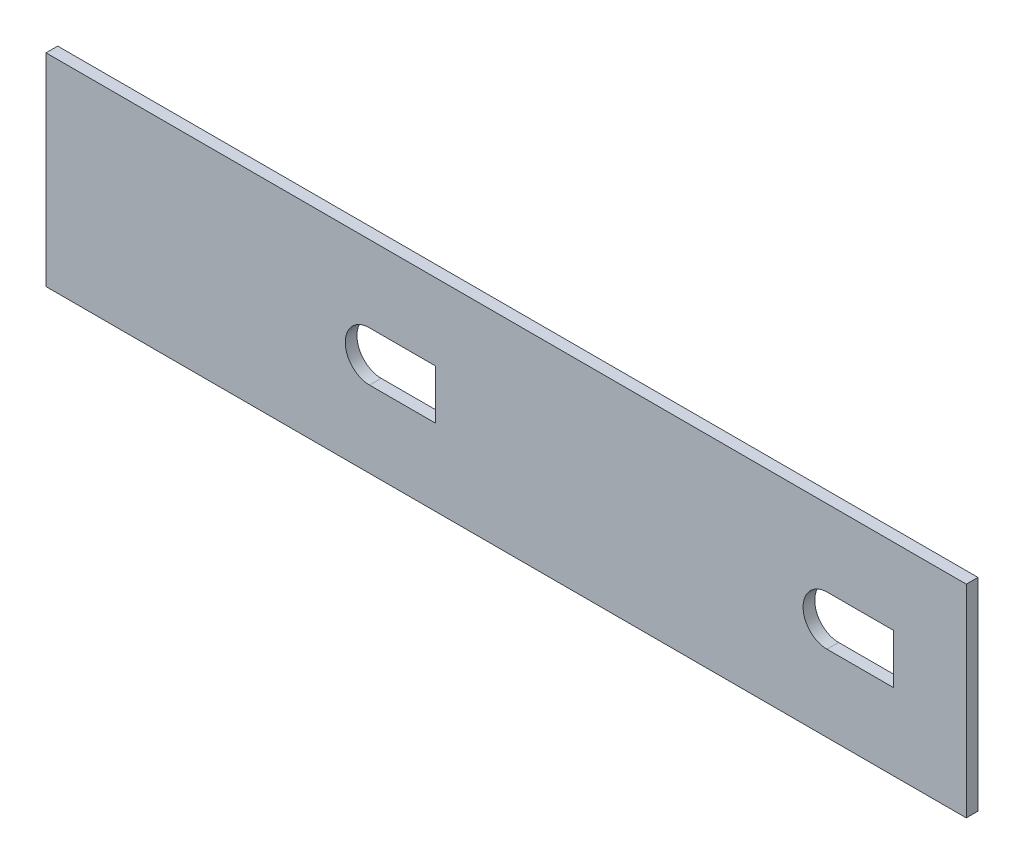
ISO-10303-21;
HEADER;
FILE_DESCRIPTION(('STEP AP214'),'2;1');
FILE_NAME('part.step','',(''),(''),'','','');
FILE_SCHEMA(('AUTOMOTIVE_DESIGN { 1 0 10303 214 1 1 1 1 }'));
ENDSEC;
DATA;
#1=APPLICATION_CONTEXT('core data for automotive mechanical design processes');
#2=APPLICATION_PROTOCOL_DEFINITION('international standard','automotive_design',2000,#1);
#3=PRODUCT_CONTEXT('',#1,'mechanical');
#4=PRODUCT('Part','Part','',(#3));
#5=PRODUCT_RELATED_PRODUCT_CATEGORY('part','',(#4));
#6=PRODUCT_DEFINITION_FORMATION('','',#4);
#7=PRODUCT_DEFINITION_CONTEXT('part definition',#1,'design');
#8=PRODUCT_DEFINITION('design','',#6,#7);
#9=PRODUCT_DEFINITION_SHAPE('','',#8);
#10=(LENGTH_UNIT() NAMED_UNIT(*) SI_UNIT(.MILLI.,.METRE.));
#11=(NAMED_UNIT(*) PLANE_ANGLE_UNIT() SI_UNIT($,.RADIAN.));
#12=(NAMED_UNIT(*) SI_UNIT($,.STERADIAN.) SOLID_ANGLE_UNIT());
#13=UNCERTAINTY_MEASURE_WITH_UNIT(LENGTH_MEASURE(1.E-05),#10,'distance_accuracy_value','');
#14=(GEOMETRIC_REPRESENTATION_CONTEXT(3) GLOBAL_UNCERTAINTY_ASSIGNED_CONTEXT((#13)) GLOBAL_UNIT_ASSIGNED_CONTEXT((#10,
#11,#12)) REPRESENTATION_CONTEXT('',''));
#15=CARTESIAN_POINT('',(0.,0.,0.));
#16=DIRECTION('',(0.,0.,1.));
#17=DIRECTION('',(1.,0.,0.));
#18=AXIS2_PLACEMENT_3D('',#15,#16,#17);
#19=CARTESIAN_POINT('',(0.,0.,3.175));
#20=DIRECTION('',(0.,0.,1.));
#21=DIRECTION('',(1.,0.,0.));
#22=AXIS2_PLACEMENT_3D('',#19,#20,#21);
#23=PLANE('',#22);
#24=DIRECTION('',(0.,1.,0.));
#25=VECTOR('',#24,1.);
#26=CARTESIAN_POINT('',(-116.588298269734,-45.8673647715123,3.175));
#27=LINE('',#26,#25);
#28=CARTESIAN_POINT('',(-116.588298269734,-45.8673647715123,3.175));
#29=VERTEX_POINT('',#28);
#30=CARTESIAN_POINT('',(-116.588298269734,9.13263522848767,3.175));
#31=VERTEX_POINT('',#30);
#32=EDGE_CURVE('E233',#29,#31,#27,.T.);
#33=ORIENTED_EDGE('',*,*,#32,.T.);
#34=DIRECTION('',(-1.,0.,0.));
#35=VECTOR('',#34,1.);
#36=CARTESIAN_POINT('',(-116.588298269734,9.13263522848767,3.175));
#37=LINE('',#36,#35);
#38=CARTESIAN_POINT('',(-366.588298269734,9.13263522848755,3.175));
#39=VERTEX_POINT('',#38);
#40=EDGE_CURVE('E236',#31,#39,#37,.T.);
#41=ORIENTED_EDGE('',*,*,#40,.T.);
#42=DIRECTION('',(0.,-1.,0.));
#43=VECTOR('',#42,1.);
#44=CARTESIAN_POINT('',(-366.588298269734,-45.8673647715123,3.175));
#45=LINE('',#44,#43);
#46=CARTESIAN_POINT('',(-366.588298269734,-45.8673647715123,3.175));
#47=VERTEX_POINT('',#46);
#48=EDGE_CURVE('E239',#39,#47,#45,.T.);
#49=ORIENTED_EDGE('',*,*,#48,.T.);
#50=DIRECTION('',(1.,0.,0.));
#51=VECTOR('',#50,1.);
#52=CARTESIAN_POINT('',(-116.588298269734,-45.8673647715123,3.175));
#53=LINE('',#52,#51);
#54=EDGE_CURVE('E241',#47,#29,#53,.T.);
#55=ORIENTED_EDGE('',*,*,#54,.T.);
#56=EDGE_LOOP('',(#33,#41,#49,#55));
#57=FACE_BOUND('',#56,.T.);
#58=DIRECTION('',(1.,0.,0.));
#59=VECTOR('',#58,1.);
#60=CARTESIAN_POINT('',(-260.807431502234,-25.0941404029287,3.175));
#61=LINE('',#60,#59);
#62=CARTESIAN_POINT('',(-278.708074604214,-25.0941404029287,3.175));
#63=VERTEX_POINT('',#62);
#64=CARTESIAN_POINT('',(-260.807431502234,-25.0941404029287,3.175));
#65=VERTEX_POINT('',#64);
#66=EDGE_CURVE('E195',#63,#65,#61,.T.);
#67=ORIENTED_EDGE('',*,*,#66,.F.);
#68=CARTESIAN_POINT('',(-278.912898536039,-11.6361768030384,3.175));
#69=CARTESIAN_POINT('',(-279.131916674822,-11.639782512172,3.175));
#70=CARTESIAN_POINT('',(-279.349831210424,-11.6545067541227,3.175));
#71=CARTESIAN_POINT('',(-279.783435066136,-11.7063737412482,3.175));
#72=CARTESIAN_POINT('',(-280.000022760577,-11.7437646065618,3.175));
#73=CARTESIAN_POINT('',(-280.637043124068,-11.8881791536033,3.175));
#74=CARTESIAN_POINT('',(-281.04621023236,-12.0268931674069,3.175));
#75=CARTESIAN_POINT('',(-281.834248731509,-12.3871980027012,3.175));
#76=CARTESIAN_POINT('',(-282.214784616346,-12.6111121677379,3.175));
#77=CARTESIAN_POINT('',(-282.912861759893,-13.122553874468,3.175));
#78=CARTESIAN_POINT('',(-283.234876429735,-13.4115471560162,3.175));
#79=CARTESIAN_POINT('',(-283.824414261028,-14.0566248743497,3.175));
#80=CARTESIAN_POINT('',(-284.084709522503,-14.4053251273293,3.175));
#81=CARTESIAN_POINT('',(-284.420910809083,-14.9593731263771,3.175));
#82=CARTESIAN_POINT('',(-284.524173104026,-15.1495995119675,3.175));
#83=CARTESIAN_POINT('',(-284.712815971696,-15.5413110557438,3.175));
#84=CARTESIAN_POINT('',(-284.79845507392,-15.7437259809365,3.175));
#85=CARTESIAN_POINT('',(-285.023266517654,-16.3561409383512,3.175));
#86=CARTESIAN_POINT('',(-285.132324707384,-16.7740495497645,3.175));
#87=CARTESIAN_POINT('',(-285.270965185072,-17.6286218627791,3.175));
#88=CARTESIAN_POINT('',(-285.299780116642,-18.0687284411883,3.175));
#89=CARTESIAN_POINT('',(-285.276335696024,-18.9342298455293,3.175));
#90=CARTESIAN_POINT('',(-285.225127225344,-19.3631084409834,3.175));
#91=CARTESIAN_POINT('',(-285.08688705313,-20.0004026261155,3.175));
#92=CARTESIAN_POINT('',(-285.030151101492,-20.2127323467408,3.175));
#93=CARTESIAN_POINT('',(-284.897978298914,-20.6270146708075,3.175));
#94=CARTESIAN_POINT('',(-284.822460465471,-20.8297750789171,3.175));
#95=CARTESIAN_POINT('',(-284.568196741255,-21.425185334125,3.175));
#96=CARTESIAN_POINT('',(-284.362007249149,-21.8050880541426,3.175));
#97=CARTESIAN_POINT('',(-283.873373823449,-22.5294744890588,3.175));
#98=CARTESIAN_POINT('',(-283.59661711866,-22.8649512477891,3.175));
#99=CARTESIAN_POINT('',(-283.139203054796,-23.3229380661377,3.175));
#100=CARTESIAN_POINT('',(-282.979382751127,-23.468376569188,3.175));
#101=CARTESIAN_POINT('',(-282.644655500423,-23.7444239123026,3.175));
#102=CARTESIAN_POINT('',(-282.46868135323,-23.8757103624695,3.175));
#103=CARTESIAN_POINT('',(-281.925950723651,-24.2401096716848,3.175));
#104=CARTESIAN_POINT('',(-281.545469247557,-24.4441613960539,3.175));
#105=CARTESIAN_POINT('',(-280.747183383585,-24.7745008830906,3.175));
#106=CARTESIAN_POINT('',(-280.324174275533,-24.9012751160114,3.175));
#107=CARTESIAN_POINT('',(-279.47256249304,-25.0631700790159,3.175));
#108=CARTESIAN_POINT('',(-279.042415123276,-25.1000738926805,3.175));
#109=CARTESIAN_POINT('',(-278.390745869579,-25.0900135720652,3.175));
#110=CARTESIAN_POINT('',(-278.171268507705,-25.0754802197763,3.175));
#111=CARTESIAN_POINT('',(-277.739111731587,-25.0242898756455,3.175));
#112=CARTESIAN_POINT('',(-277.525754251972,-24.9877487471008,3.175));
#113=CARTESIAN_POINT('',(-276.893723712456,-24.845773563563,3.175));
#114=CARTESIAN_POINT('',(-276.481407708899,-24.7075324574291,3.175));
#115=CARTESIAN_POINT('',(-275.68580227921,-24.3447317478795,3.175));
#116=CARTESIAN_POINT('',(-275.312912036775,-24.125382445066,3.175));
#117=CARTESIAN_POINT('',(-274.614334688409,-23.6147797206934,3.175));
#118=CARTESIAN_POINT('',(-274.286000737899,-23.3198793534679,3.175));
#119=CARTESIAN_POINT('',(-273.701353111616,-22.6797882693016,3.175));
#120=CARTESIAN_POINT('',(-273.442401645168,-22.3337290719831,3.175));
#121=CARTESIAN_POINT('',(-273.103915315638,-21.7757115009341,3.175));
#122=CARTESIAN_POINT('',(-272.999232084365,-21.5824418001571,3.175));
#123=CARTESIAN_POINT('',(-272.810989467098,-21.1906197868943,3.175));
#124=CARTESIAN_POINT('',(-272.726849305368,-20.9912465703473,3.175));
#125=CARTESIAN_POINT('',(-272.503681123503,-20.3829800292127,3.175));
#126=CARTESIAN_POINT('',(-272.393489747306,-19.9628720817838,3.175));
#127=CARTESIAN_POINT('',(-272.253803506482,-19.0996870601968,3.175));
#128=CARTESIAN_POINT('',(-272.22593398818,-18.6678893045974,3.175));
#129=CARTESIAN_POINT('',(-272.24295303804,-18.0199050336884,3.175));
#130=CARTESIAN_POINT('',(-272.258501289417,-17.803861988258,3.175));
#131=CARTESIAN_POINT('',(-272.310088345661,-17.3716757015724,3.175));
#132=CARTESIAN_POINT('',(-272.34634540777,-17.1550328004097,3.175));
#133=CARTESIAN_POINT('',(-272.484097751252,-16.5183338467588,3.175));
#134=CARTESIAN_POINT('',(-272.614630030133,-16.1070815582768,3.175));
#135=CARTESIAN_POINT('',(-272.952678310244,-15.3108639866644,3.175));
#136=CARTESIAN_POINT('',(-273.162879529171,-14.9228796155057,3.175));
#137=CARTESIAN_POINT('',(-273.645931797489,-14.2045866349294,3.175));
#138=CARTESIAN_POINT('',(-273.919455939364,-13.8708342888772,3.175));
#139=CARTESIAN_POINT('',(-274.37879561396,-13.4091354023843,3.175));
#140=CARTESIAN_POINT('',(-274.541118736385,-13.2610357004114,3.175));
#141=CARTESIAN_POINT('',(-274.8766978243,-12.9837857768622,3.175));
#142=CARTESIAN_POINT('',(-275.050131540329,-12.8542682466998,3.175));
#143=CARTESIAN_POINT('',(-275.587150536821,-12.4926915632331,3.175));
#144=CARTESIAN_POINT('',(-275.967280826889,-12.2873294244025,3.175));
#145=CARTESIAN_POINT('',(-276.774712524021,-11.952720423989,3.175));
#146=CARTESIAN_POINT('',(-277.191590830766,-11.8283111720665,3.175));
#147=CARTESIAN_POINT('',(-278.039372362542,-11.666736750691,3.175));
#148=CARTESIAN_POINT('',(-278.474862258472,-11.6289653847712,3.175));
#149=CARTESIAN_POINT('',(-278.912898536039,-11.6361768030384,3.175));
#150=B_SPLINE_CURVE_WITH_KNOTS('',3,(#68,#69,#70,#71,#72,#73,#74,#75,#76,#77,#78,#79,#80,#81,
#82,#83,#84,#85,#86,#87,#88,#89,#90,#91,#92,#93,#94,#95,#96,#97,#98,#99,#100,#101,#102,#103,
#104,#105,#106,#107,#108,#109,#110,#111,#112,#113,#114,#115,#116,#117,#118,#119,#120,#121,#122,
#123,#124,#125,#126,#127,#128,#129,#130,#131,#132,#133,#134,#135,#136,#137,#138,#139,#140,#141,
#142,#143,#144,#145,#146,#147,#148,#149),.UNSPECIFIED.,.T.,.F.,(4,2,2,2,2,2,2,2,2,2,2,2,2,2,2,2,
2,2,2,2,2,2,2,2,2,2,2,2,2,2,2,2,2,2,2,2,2,2,2,2,4),(0.,0.015624999999999,0.031249999999998,
0.0624999999999921,0.0937499999999862,0.12499999999998,0.156249999999974,0.171874999999972,
0.187499999999971,0.218749999999967,0.249999999999963,0.281249999999959,0.296874999999957,
0.312499999999955,0.343749999999951,0.374999999999948,0.390624999999947,0.406249999999947,
0.437499999999946,0.468749999999945,0.499999999999944,0.515624999999944,0.531249999999944,
0.562499999999947,0.59374999999995,0.624999999999953,0.656249999999956,0.671874999999958,
0.687499999999959,0.718749999999964,0.749999999999968,0.765624999999971,0.781249999999973,
0.812499999999977,0.843749999999981,0.874999999999985,0.890624999999986,0.906249999999988,
0.937499999999992,0.968749999999996,1.),.UNSPECIFIED.);
#151=CARTESIAN_POINT('',(-278.807431502234,-11.6353087130551,3.175));
#152=VERTEX_POINT('',#151);
#153=EDGE_CURVE('E190',#152,#63,#150,.T.);
#154=ORIENTED_EDGE('',*,*,#153,.F.);
#155=DIRECTION('',(-1.,0.,0.));
#156=VECTOR('',#155,1.);
#157=CARTESIAN_POINT('',(-278.807431502234,-11.6353087130551,3.175));
#158=LINE('',#157,#156);
#159=CARTESIAN_POINT('',(-260.807431502234,-11.6353087130551,3.175));
#160=VERTEX_POINT('',#159);
#161=EDGE_CURVE('E205',#160,#152,#158,.T.);
#162=ORIENTED_EDGE('',*,*,#161,.F.);
#163=DIRECTION('',(0.,1.,0.));
#164=VECTOR('',#163,1.);
#165=CARTESIAN_POINT('',(-260.807431502234,-11.6353087130551,3.175));
#166=LINE('',#165,#164);
#167=EDGE_CURVE('E202',#65,#160,#166,.T.);
#168=ORIENTED_EDGE('',*,*,#167,.F.);
#169=EDGE_LOOP('',(#67,#154,#162,#168));
#170=FACE_BOUND('',#169,.T.);
#171=DIRECTION('',(0.,1.,0.));
#172=VECTOR('',#171,1.);
#173=CARTESIAN_POINT('',(-136.360316653924,-11.6352983209249,3.175));
#174=LINE('',#173,#172);
#175=CARTESIAN_POINT('',(-136.360316653924,-25.0941408698121,3.175));
#176=VERTEX_POINT('',#175);
#177=CARTESIAN_POINT('',(-136.360316653924,-11.6352983209249,3.175));
#178=VERTEX_POINT('',#177);
#179=EDGE_CURVE('E134',#176,#178,#174,.T.);
#180=ORIENTED_EDGE('',*,*,#179,.F.);
#181=DIRECTION('',(1.,0.,0.));
#182=VECTOR('',#181,1.);
#183=CARTESIAN_POINT('',(-136.360316653924,-25.0941408698121,3.175));
#184=LINE('',#183,#182);
#185=CARTESIAN_POINT('',(-154.458489547895,-25.0941408698121,3.175));
#186=VERTEX_POINT('',#185);
#187=EDGE_CURVE('E126',#186,#176,#184,.T.);
#188=ORIENTED_EDGE('',*,*,#187,.F.);
#189=CARTESIAN_POINT('',(-154.253698003428,-11.6361768030384,3.175));
#190=CARTESIAN_POINT('',(-154.691712233249,-11.6289657477446,3.175));
#191=CARTESIAN_POINT('',(-155.122898936232,-11.6661756024197,3.175));
#192=CARTESIAN_POINT('',(-155.759665344846,-11.7871406609081,3.175));
#193=CARTESIAN_POINT('',(-155.970243268795,-11.838376709376,3.175));
#194=CARTESIAN_POINT('',(-156.387966493084,-11.9631819685109,3.175));
#195=CARTESIAN_POINT('',(-156.594872021722,-12.0368503456677,3.175));
#196=CARTESIAN_POINT('',(-157.196347850727,-12.286080819597,3.175));
#197=CARTESIAN_POINT('',(-157.576755859107,-12.4909158342852,3.175));
#198=CARTESIAN_POINT('',(-158.117253538185,-12.8547814232762,3.175));
#199=CARTESIAN_POINT('',(-158.293226627451,-12.9863539565378,3.175));
#200=CARTESIAN_POINT('',(-158.628820603047,-13.263982392223,3.175));
#201=CARTESIAN_POINT('',(-158.788816485806,-13.4101337432122,3.175));
#202=CARTESIAN_POINT('',(-159.246155665552,-13.869889243646,3.175));
#203=CARTESIAN_POINT('',(-159.521251184526,-14.2048411314247,3.175));
#204=CARTESIAN_POINT('',(-160.009167015456,-14.9316089281286,3.175));
#205=CARTESIAN_POINT('',(-160.214692704125,-15.3124883292231,3.175));
#206=CARTESIAN_POINT('',(-160.467795080561,-15.9089298251185,3.175));
#207=CARTESIAN_POINT('',(-160.542897196405,-16.111961519196,3.175));
#208=CARTESIAN_POINT('',(-160.674225623294,-16.5266177400384,3.175));
#209=CARTESIAN_POINT('',(-160.73053076893,-16.7390370159584,3.175));
#210=CARTESIAN_POINT('',(-160.867597894895,-17.3765609202522,3.175));
#211=CARTESIAN_POINT('',(-160.918148194315,-17.8054738237285,3.175));
#212=CARTESIAN_POINT('',(-160.940601814657,-18.6708063985658,3.175));
#213=CARTESIAN_POINT('',(-160.91140250479,-19.1109371693505,3.175));
#214=CARTESIAN_POINT('',(-160.772322277278,-19.9650205425037,3.175));
#215=CARTESIAN_POINT('',(-160.663242958013,-20.3823139427868,3.175));
#216=CARTESIAN_POINT('',(-160.438953588637,-20.993295919286,3.175));
#217=CARTESIAN_POINT('',(-160.353444121514,-21.1955504150172,3.175));
#218=CARTESIAN_POINT('',(-160.164485448827,-21.5879942732553,3.175));
#219=CARTESIAN_POINT('',(-160.061148170924,-21.778323472938,3.175));
#220=CARTESIAN_POINT('',(-159.725133031893,-22.3320124206401,3.175));
#221=CARTESIAN_POINT('',(-159.466726660237,-22.6782563240455,3.175));
#222=CARTESIAN_POINT('',(-158.877844125332,-23.3227998336985,3.175));
#223=CARTESIAN_POINT('',(-158.553373423136,-23.613738750951,3.175));
#224=CARTESIAN_POINT('',(-158.03111231468,-23.9958104309788,3.175));
#225=CARTESIAN_POINT('',(-157.850620858108,-24.1145230583444,3.175));
#226=CARTESIAN_POINT('',(-157.476451568913,-24.3341495225828,3.175));
#227=CARTESIAN_POINT('',(-157.281538298329,-24.4355808412174,3.175));
#228=CARTESIAN_POINT('',(-156.686819382033,-24.7068144583153,3.175));
#229=CARTESIAN_POINT('',(-156.277513307968,-24.8444364888813,3.175));
#230=CARTESIAN_POINT('',(-155.433635451851,-25.0345861771423,3.175));
#231=CARTESIAN_POINT('',(-154.994831316035,-25.086418439913,3.175));
#232=CARTESIAN_POINT('',(-154.128792493361,-25.1002156950432,3.175));
#233=CARTESIAN_POINT('',(-153.697992470136,-25.0638319702655,3.175));
#234=CARTESIAN_POINT('',(-153.055252413593,-24.9417801274765,3.175));
#235=CARTESIAN_POINT('',(-152.841937516171,-24.8896935780756,3.175));
#236=CARTESIAN_POINT('',(-152.426159213167,-24.7653526120595,3.175));
#237=CARTESIAN_POINT('',(-152.018742370563,-24.6204361644559,3.175));
#238=CARTESIAN_POINT('',(-151.627659180748,-24.4353266457641,3.175));
#239=CARTESIAN_POINT('',(-151.244775415675,-24.2300403750747,3.175));
#240=CARTESIAN_POINT('',(-151.056500240454,-24.1166154283959,3.175));
#241=CARTESIAN_POINT('',(-150.514331472795,-23.7521562472764,3.175));
#242=CARTESIAN_POINT('',(-150.181019235346,-23.4767707839815,3.175));
#243=CARTESIAN_POINT('',(-149.568597498411,-22.8635529860615,3.175));
#244=CARTESIAN_POINT('',(-149.288376545101,-22.5227593107934,3.175));
#245=CARTESIAN_POINT('',(-148.804783664405,-21.8049025311545,3.175));
#246=CARTESIAN_POINT('',(-148.598217386276,-21.4253527628991,3.175));
#247=CARTESIAN_POINT('',(-148.342055881984,-20.8246028005055,3.175));
#248=CARTESIAN_POINT('',(-148.265654348089,-20.6186104654015,3.175));
#249=CARTESIAN_POINT('',(-148.13414588494,-20.2046027084347,3.175));
#250=CARTESIAN_POINT('',(-148.078550363647,-19.9955713101974,3.175));
#251=CARTESIAN_POINT('',(-147.941568500518,-19.3625285631728,3.175));
#252=CARTESIAN_POINT('',(-147.889778489453,-18.9319063802534,3.175));
#253=CARTESIAN_POINT('',(-147.866936161587,-18.0574219427363,3.175));
#254=CARTESIAN_POINT('',(-147.895986190313,-17.6257634125654,3.175));
#255=CARTESIAN_POINT('',(-147.999844920188,-16.9865927760536,3.175));
#256=CARTESIAN_POINT('',(-148.044559530182,-16.7749286785731,3.175));
#257=CARTESIAN_POINT('',(-148.154763972018,-16.3544667784135,3.175));
#258=CARTESIAN_POINT('',(-148.220680703005,-16.1447229449427,3.175));
#259=CARTESIAN_POINT('',(-148.446208261836,-15.5325099404277,3.175));
#260=CARTESIAN_POINT('',(-148.633759728698,-15.1437419687815,3.175));
#261=CARTESIAN_POINT('',(-149.082425878788,-14.4045185313681,3.175));
#262=CARTESIAN_POINT('',(-149.346972187966,-14.0510475220236,3.175));
#263=CARTESIAN_POINT('',(-149.931635293614,-13.4119788690364,3.175));
#264=CARTESIAN_POINT('',(-150.252554247251,-13.1234032201009,3.175));
#265=CARTESIAN_POINT('',(-150.778110023312,-12.7383815287112,3.175));
#266=CARTESIAN_POINT('',(-150.96183668745,-12.6174886903645,3.175));
#267=CARTESIAN_POINT('',(-151.337303564448,-12.3970737762595,3.175));
#268=CARTESIAN_POINT('',(-151.529354662003,-12.2971521439434,3.175));
#269=CARTESIAN_POINT('',(-152.118274542895,-12.0278006926258,3.175));
#270=CARTESIAN_POINT('',(-152.527795211113,-11.8885110650482,3.175));
#271=CARTESIAN_POINT('',(-153.382495601008,-11.694881262676,3.175));
#272=CARTESIAN_POINT('',(-153.815683773607,-11.6433878583322,3.175));
#273=CARTESIAN_POINT('',(-154.253698003428,-11.6361768030384,3.175));
#274=B_SPLINE_CURVE_WITH_KNOTS('',3,(#189,#190,#191,#192,#193,#194,#195,#196,#197,#198,#199,
#200,#201,#202,#203,#204,#205,#206,#207,#208,#209,#210,#211,#212,#213,#214,#215,#216,#217,#218,
#219,#220,#221,#222,#223,#224,#225,#226,#227,#228,#229,#230,#231,#232,#233,#234,#235,#236,#237,
#238,#239,#240,#241,#242,#243,#244,#245,#246,#247,#248,#249,#250,#251,#252,#253,#254,#255,#256,
#257,#258,#259,#260,#261,#262,#263,#264,#265,#266,#267,#268,#269,#270,#271,#272,#273),
.UNSPECIFIED.,.T.,.F.,(4,2,2,2,2,2,2,2,2,2,2,2,2,2,2,2,2,2,2,2,2,2,2,2,1,2,2,2,2,2,2,2,2,2,2,2,
2,2,2,2,2,2,4),(0.,0.0312499999999974,0.0468749999999971,0.0624999999999968,0.0937499999999961,
0.109374999999995,0.124999999999994,0.156249999999991,0.187499999999989,0.203124999999988,
0.218749999999987,0.249999999999985,0.281249999999983,0.312499999999981,0.32812499999998,
0.343749999999979,0.374999999999979,0.406249999999978,0.421874999999979,0.437499999999979,
0.46874999999998,0.499999999999981,0.531249999999982,0.546874999999983,0.562499999999983,
0.578124999999983,0.593749999999984,0.624999999999985,0.656249999999986,0.687499999999987,
0.703124999999988,0.718749999999988,0.749999999999989,0.781249999999991,0.796874999999991,
0.812499999999992,0.843749999999993,0.874999999999995,0.906249999999996,0.921874999999997,
0.937499999999997,0.968749999999999,1.),.UNSPECIFIED.);
#275=CARTESIAN_POINT('',(-154.360316653924,-11.6352983209249,3.175));
#276=VERTEX_POINT('',#275);
#277=EDGE_CURVE('E148',#276,#186,#274,.T.);
#278=ORIENTED_EDGE('',*,*,#277,.F.);
#279=DIRECTION('',(-1.,0.,0.));
#280=VECTOR('',#279,1.);
#281=CARTESIAN_POINT('',(-154.360316653924,-11.6352983209249,3.175));
#282=LINE('',#281,#280);
#283=EDGE_CURVE('E146',#178,#276,#282,.T.);
#284=ORIENTED_EDGE('',*,*,#283,.F.);
#285=EDGE_LOOP('',(#180,#188,#278,#284));
#286=FACE_BOUND('',#285,.T.);
#287=ADVANCED_FACE('F37',(#57,#170,#286),#23,.T.);
#288=CARTESIAN_POINT('',(0.,0.,0.));
#289=DIRECTION('',(0.,0.,1.));
#290=DIRECTION('',(1.,0.,0.));
#291=AXIS2_PLACEMENT_3D('',#288,#289,#290);
#292=PLANE('',#291);
#293=CARTESIAN_POINT('',(-278.912898536039,-11.6361768030384,0.));
#294=CARTESIAN_POINT('',(-279.131916674822,-11.639782512172,0.));
#295=CARTESIAN_POINT('',(-279.349831210424,-11.6545067541227,0.));
#296=CARTESIAN_POINT('',(-279.783435066136,-11.7063737412482,0.));
#297=CARTESIAN_POINT('',(-280.000022760577,-11.7437646065618,0.));
#298=CARTESIAN_POINT('',(-280.637043124068,-11.8881791536033,0.));
#299=CARTESIAN_POINT('',(-281.04621023236,-12.0268931674069,0.));
#300=CARTESIAN_POINT('',(-281.834248731509,-12.3871980027012,0.));
#301=CARTESIAN_POINT('',(-282.214784616346,-12.6111121677379,0.));
#302=CARTESIAN_POINT('',(-282.912861759893,-13.122553874468,0.));
#303=CARTESIAN_POINT('',(-283.234876429735,-13.4115471560162,0.));
#304=CARTESIAN_POINT('',(-283.824414261028,-14.0566248743497,0.));
#305=CARTESIAN_POINT('',(-284.084709522503,-14.4053251273293,0.));
#306=CARTESIAN_POINT('',(-284.420910809083,-14.9593731263771,0.));
#307=CARTESIAN_POINT('',(-284.524173104026,-15.1495995119675,0.));
#308=CARTESIAN_POINT('',(-284.712815971696,-15.5413110557438,0.));
#309=CARTESIAN_POINT('',(-284.79845507392,-15.7437259809365,0.));
#310=CARTESIAN_POINT('',(-285.023266517654,-16.3561409383512,0.));
#311=CARTESIAN_POINT('',(-285.132324707384,-16.7740495497645,0.));
#312=CARTESIAN_POINT('',(-285.270965185072,-17.6286218627791,0.));
#313=CARTESIAN_POINT('',(-285.299780116642,-18.0687284411883,0.));
#314=CARTESIAN_POINT('',(-285.276335696024,-18.9342298455293,0.));
#315=CARTESIAN_POINT('',(-285.225127225344,-19.3631084409834,0.));
#316=CARTESIAN_POINT('',(-285.08688705313,-20.0004026261155,0.));
#317=CARTESIAN_POINT('',(-285.030151101492,-20.2127323467408,0.));
#318=CARTESIAN_POINT('',(-284.897978298914,-20.6270146708075,0.));
#319=CARTESIAN_POINT('',(-284.822460465471,-20.8297750789171,0.));
#320=CARTESIAN_POINT('',(-284.568196741255,-21.425185334125,0.));
#321=CARTESIAN_POINT('',(-284.362007249149,-21.8050880541426,0.));
#322=CARTESIAN_POINT('',(-283.873373823449,-22.5294744890588,0.));
#323=CARTESIAN_POINT('',(-283.59661711866,-22.8649512477891,0.));
#324=CARTESIAN_POINT('',(-283.139203054796,-23.3229380661377,0.));
#325=CARTESIAN_POINT('',(-282.979382751127,-23.468376569188,0.));
#326=CARTESIAN_POINT('',(-282.644655500423,-23.7444239123026,0.));
#327=CARTESIAN_POINT('',(-282.46868135323,-23.8757103624695,0.));
#328=CARTESIAN_POINT('',(-281.925950723651,-24.2401096716848,0.));
#329=CARTESIAN_POINT('',(-281.545469247557,-24.4441613960539,0.));
#330=CARTESIAN_POINT('',(-280.747183383585,-24.7745008830906,0.));
#331=CARTESIAN_POINT('',(-280.324174275533,-24.9012751160114,0.));
#332=CARTESIAN_POINT('',(-279.47256249304,-25.0631700790159,0.));
#333=CARTESIAN_POINT('',(-279.042415123276,-25.1000738926805,0.));
#334=CARTESIAN_POINT('',(-278.390745869579,-25.0900135720652,0.));
#335=CARTESIAN_POINT('',(-278.171268507705,-25.0754802197763,0.));
#336=CARTESIAN_POINT('',(-277.739111731587,-25.0242898756455,0.));
#337=CARTESIAN_POINT('',(-277.525754251972,-24.9877487471008,0.));
#338=CARTESIAN_POINT('',(-276.893723712456,-24.845773563563,0.));
#339=CARTESIAN_POINT('',(-276.481407708899,-24.7075324574291,0.));
#340=CARTESIAN_POINT('',(-275.68580227921,-24.3447317478795,0.));
#341=CARTESIAN_POINT('',(-275.312912036775,-24.125382445066,0.));
#342=CARTESIAN_POINT('',(-274.614334688409,-23.6147797206934,0.));
#343=CARTESIAN_POINT('',(-274.286000737899,-23.3198793534679,0.));
#344=CARTESIAN_POINT('',(-273.701353111616,-22.6797882693016,0.));
#345=CARTESIAN_POINT('',(-273.442401645168,-22.3337290719831,0.));
#346=CARTESIAN_POINT('',(-273.103915315638,-21.7757115009341,0.));
#347=CARTESIAN_POINT('',(-272.999232084365,-21.5824418001571,0.));
#348=CARTESIAN_POINT('',(-272.810989467098,-21.1906197868943,0.));
#349=CARTESIAN_POINT('',(-272.726849305368,-20.9912465703473,0.));
#350=CARTESIAN_POINT('',(-272.503681123503,-20.3829800292127,0.));
#351=CARTESIAN_POINT('',(-272.393489747306,-19.9628720817838,0.));
#352=CARTESIAN_POINT('',(-272.253803506482,-19.0996870601968,0.));
#353=CARTESIAN_POINT('',(-272.22593398818,-18.6678893045974,0.));
#354=CARTESIAN_POINT('',(-272.24295303804,-18.0199050336884,0.));
#355=CARTESIAN_POINT('',(-272.258501289417,-17.803861988258,0.));
#356=CARTESIAN_POINT('',(-272.310088345661,-17.3716757015724,0.));
#357=CARTESIAN_POINT('',(-272.34634540777,-17.1550328004097,0.));
#358=CARTESIAN_POINT('',(-272.484097751252,-16.5183338467588,0.));
#359=CARTESIAN_POINT('',(-272.614630030133,-16.1070815582768,0.));
#360=CARTESIAN_POINT('',(-272.952678310244,-15.3108639866644,0.));
#361=CARTESIAN_POINT('',(-273.162879529171,-14.9228796155057,0.));
#362=CARTESIAN_POINT('',(-273.645931797489,-14.2045866349294,0.));
#363=CARTESIAN_POINT('',(-273.919455939364,-13.8708342888772,0.));
#364=CARTESIAN_POINT('',(-274.37879561396,-13.4091354023843,0.));
#365=CARTESIAN_POINT('',(-274.541118736385,-13.2610357004114,0.));
#366=CARTESIAN_POINT('',(-274.8766978243,-12.9837857768622,0.));
#367=CARTESIAN_POINT('',(-275.050131540329,-12.8542682466998,0.));
#368=CARTESIAN_POINT('',(-275.587150536821,-12.4926915632331,0.));
#369=CARTESIAN_POINT('',(-275.967280826889,-12.2873294244025,0.));
#370=CARTESIAN_POINT('',(-276.774712524021,-11.952720423989,0.));
#371=CARTESIAN_POINT('',(-277.191590830766,-11.8283111720665,0.));
#372=CARTESIAN_POINT('',(-278.039372362542,-11.666736750691,0.));
#373=CARTESIAN_POINT('',(-278.474862258472,-11.6289653847712,0.));
#374=CARTESIAN_POINT('',(-278.912898536039,-11.6361768030384,0.));
#375=B_SPLINE_CURVE_WITH_KNOTS('',3,(#293,#294,#295,#296,#297,#298,#299,#300,#301,#302,#303,
#304,#305,#306,#307,#308,#309,#310,#311,#312,#313,#314,#315,#316,#317,#318,#319,#320,#321,#322,
#323,#324,#325,#326,#327,#328,#329,#330,#331,#332,#333,#334,#335,#336,#337,#338,#339,#340,#341,
#342,#343,#344,#345,#346,#347,#348,#349,#350,#351,#352,#353,#354,#355,#356,#357,#358,#359,#360,
#361,#362,#363,#364,#365,#366,#367,#368,#369,#370,#371,#372,#373,#374),.UNSPECIFIED.,.T.,.F.,(4,
2,2,2,2,2,2,2,2,2,2,2,2,2,2,2,2,2,2,2,2,2,2,2,2,2,2,2,2,2,2,2,2,2,2,2,2,2,2,2,4),(0.,
0.015624999999999,0.031249999999998,0.0624999999999921,0.0937499999999862,0.12499999999998,
0.156249999999974,0.171874999999972,0.187499999999971,0.218749999999967,0.249999999999963,
0.281249999999959,0.296874999999957,0.312499999999955,0.343749999999951,0.374999999999948,
0.390624999999947,0.406249999999947,0.437499999999946,0.468749999999945,0.499999999999944,
0.515624999999944,0.531249999999944,0.562499999999947,0.59374999999995,0.624999999999953,
0.656249999999956,0.671874999999958,0.687499999999959,0.718749999999964,0.749999999999968,
0.765624999999971,0.781249999999973,0.812499999999977,0.843749999999981,0.874999999999985,
0.890624999999986,0.906249999999988,0.937499999999992,0.968749999999996,1.),.UNSPECIFIED.);
#376=CARTESIAN_POINT('',(-278.807431502234,-11.6353087130551,0.));
#377=VERTEX_POINT('',#376);
#378=CARTESIAN_POINT('',(-278.708074604214,-25.0941404029287,0.));
#379=VERTEX_POINT('',#378);
#380=EDGE_CURVE('E142',#377,#379,#375,.T.);
#381=ORIENTED_EDGE('',*,*,#380,.T.);
#382=DIRECTION('',(1.,0.,0.));
#383=VECTOR('',#382,1.);
#384=CARTESIAN_POINT('',(-260.807431502234,-25.0941404029287,0.));
#385=LINE('',#384,#383);
#386=CARTESIAN_POINT('',(-260.807431502234,-25.0941404029287,0.));
#387=VERTEX_POINT('',#386);
#388=EDGE_CURVE('E212',#379,#387,#385,.T.);
#389=ORIENTED_EDGE('',*,*,#388,.T.);
#390=DIRECTION('',(0.,1.,0.));
#391=VECTOR('',#390,1.);
#392=CARTESIAN_POINT('',(-260.807431502234,-11.6353087130551,0.));
#393=LINE('',#392,#391);
#394=CARTESIAN_POINT('',(-260.807431502234,-11.6353087130551,0.));
#395=VERTEX_POINT('',#394);
#396=EDGE_CURVE('E218',#387,#395,#393,.T.);
#397=ORIENTED_EDGE('',*,*,#396,.T.);
#398=DIRECTION('',(-1.,0.,0.));
#399=VECTOR('',#398,1.);
#400=CARTESIAN_POINT('',(-278.807431502234,-11.6353087130551,0.));
#401=LINE('',#400,#399);
#402=EDGE_CURVE('E196',#395,#377,#401,.T.);
#403=ORIENTED_EDGE('',*,*,#402,.T.);
#404=EDGE_LOOP('',(#381,#389,#397,#403));
#405=FACE_BOUND('',#404,.T.);
#406=DIRECTION('',(0.,1.,0.));
#407=VECTOR('',#406,1.);
#408=CARTESIAN_POINT('',(-116.588298269734,-45.8673647715123,0.));
#409=LINE('',#408,#407);
#410=CARTESIAN_POINT('',(-116.588298269734,-45.8673647715123,0.));
#411=VERTEX_POINT('',#410);
#412=CARTESIAN_POINT('',(-116.588298269734,9.13263522848767,0.));
#413=VERTEX_POINT('',#412);
#414=EDGE_CURVE('E232',#411,#413,#409,.T.);
#415=ORIENTED_EDGE('',*,*,#414,.F.);
#416=DIRECTION('',(1.,0.,0.));
#417=VECTOR('',#416,1.);
#418=CARTESIAN_POINT('',(-116.588298269734,-45.8673647715123,0.));
#419=LINE('',#418,#417);
#420=CARTESIAN_POINT('',(-366.588298269734,-45.8673647715123,0.));
#421=VERTEX_POINT('',#420);
#422=EDGE_CURVE('E237',#421,#411,#419,.T.);
#423=ORIENTED_EDGE('',*,*,#422,.F.);
#424=DIRECTION('',(0.,-1.,0.));
#425=VECTOR('',#424,1.);
#426=CARTESIAN_POINT('',(-366.588298269734,-45.8673647715123,0.));
#427=LINE('',#426,#425);
#428=CARTESIAN_POINT('',(-366.588298269734,9.13263522848755,0.));
#429=VERTEX_POINT('',#428);
#430=EDGE_CURVE('E248',#429,#421,#427,.T.);
#431=ORIENTED_EDGE('',*,*,#430,.F.);
#432=DIRECTION('',(-1.,0.,0.));
#433=VECTOR('',#432,1.);
#434=CARTESIAN_POINT('',(-116.588298269734,9.13263522848767,0.));
#435=LINE('',#434,#433);
#436=EDGE_CURVE('E246',#413,#429,#435,.T.);
#437=ORIENTED_EDGE('',*,*,#436,.F.);
#438=EDGE_LOOP('',(#415,#423,#431,#437));
#439=FACE_BOUND('',#438,.T.);
#440=DIRECTION('',(1.,0.,0.));
#441=VECTOR('',#440,1.);
#442=CARTESIAN_POINT('',(-136.360316653924,-25.0941408698121,0.));
#443=LINE('',#442,#441);
#444=CARTESIAN_POINT('',(-154.458489547895,-25.0941408698121,0.));
#445=VERTEX_POINT('',#444);
#446=CARTESIAN_POINT('',(-136.360316653924,-25.0941408698121,0.));
#447=VERTEX_POINT('',#446);
#448=EDGE_CURVE('E60',#445,#447,#443,.T.);
#449=ORIENTED_EDGE('',*,*,#448,.T.);
#450=DIRECTION('',(0.,1.,0.));
#451=VECTOR('',#450,1.);
#452=CARTESIAN_POINT('',(-136.360316653924,-11.6352983209249,0.));
#453=LINE('',#452,#451);
#454=CARTESIAN_POINT('',(-136.360316653924,-11.6352983209249,0.));
#455=VERTEX_POINT('',#454);
#456=EDGE_CURVE('E141',#447,#455,#453,.T.);
#457=ORIENTED_EDGE('',*,*,#456,.T.);
#458=DIRECTION('',(-1.,0.,0.));
#459=VECTOR('',#458,1.);
#460=CARTESIAN_POINT('',(-154.360316653924,-11.6352983209249,0.));
#461=LINE('',#460,#459);
#462=CARTESIAN_POINT('',(-154.360316653924,-11.6352983209249,0.));
#463=VERTEX_POINT('',#462);
#464=EDGE_CURVE('E409',#455,#463,#461,.T.);
#465=ORIENTED_EDGE('',*,*,#464,.T.);
#466=CARTESIAN_POINT('',(-154.253698003428,-11.6361768030384,0.));
#467=CARTESIAN_POINT('',(-154.691712233249,-11.6289657477446,0.));
#468=CARTESIAN_POINT('',(-155.122898936232,-11.6661756024197,0.));
#469=CARTESIAN_POINT('',(-155.759665344846,-11.7871406609081,0.));
#470=CARTESIAN_POINT('',(-155.970243268795,-11.838376709376,0.));
#471=CARTESIAN_POINT('',(-156.387966493084,-11.9631819685109,0.));
#472=CARTESIAN_POINT('',(-156.594872021722,-12.0368503456677,0.));
#473=CARTESIAN_POINT('',(-157.196347850727,-12.286080819597,0.));
#474=CARTESIAN_POINT('',(-157.576755859107,-12.4909158342852,0.));
#475=CARTESIAN_POINT('',(-158.117253538185,-12.8547814232762,0.));
#476=CARTESIAN_POINT('',(-158.293226627451,-12.9863539565378,0.));
#477=CARTESIAN_POINT('',(-158.628820603047,-13.263982392223,0.));
#478=CARTESIAN_POINT('',(-158.788816485806,-13.4101337432122,0.));
#479=CARTESIAN_POINT('',(-159.246155665552,-13.869889243646,0.));
#480=CARTESIAN_POINT('',(-159.521251184526,-14.2048411314247,0.));
#481=CARTESIAN_POINT('',(-160.009167015456,-14.9316089281286,0.));
#482=CARTESIAN_POINT('',(-160.214692704125,-15.3124883292231,0.));
#483=CARTESIAN_POINT('',(-160.467795080561,-15.9089298251185,0.));
#484=CARTESIAN_POINT('',(-160.542897196405,-16.111961519196,0.));
#485=CARTESIAN_POINT('',(-160.674225623294,-16.5266177400384,0.));
#486=CARTESIAN_POINT('',(-160.73053076893,-16.7390370159584,0.));
#487=CARTESIAN_POINT('',(-160.867597894895,-17.3765609202522,0.));
#488=CARTESIAN_POINT('',(-160.918148194315,-17.8054738237285,0.));
#489=CARTESIAN_POINT('',(-160.940601814657,-18.6708063985658,0.));
#490=CARTESIAN_POINT('',(-160.91140250479,-19.1109371693505,0.));
#491=CARTESIAN_POINT('',(-160.772322277278,-19.9650205425037,0.));
#492=CARTESIAN_POINT('',(-160.663242958013,-20.3823139427868,0.));
#493=CARTESIAN_POINT('',(-160.438953588637,-20.993295919286,0.));
#494=CARTESIAN_POINT('',(-160.353444121514,-21.1955504150172,0.));
#495=CARTESIAN_POINT('',(-160.164485448827,-21.5879942732553,0.));
#496=CARTESIAN_POINT('',(-160.061148170924,-21.778323472938,0.));
#497=CARTESIAN_POINT('',(-159.725133031893,-22.3320124206401,0.));
#498=CARTESIAN_POINT('',(-159.466726660237,-22.6782563240455,0.));
#499=CARTESIAN_POINT('',(-158.877844125332,-23.3227998336985,0.));
#500=CARTESIAN_POINT('',(-158.553373423136,-23.613738750951,0.));
#501=CARTESIAN_POINT('',(-158.03111231468,-23.9958104309788,0.));
#502=CARTESIAN_POINT('',(-157.850620858108,-24.1145230583444,0.));
#503=CARTESIAN_POINT('',(-157.476451568913,-24.3341495225828,0.));
#504=CARTESIAN_POINT('',(-157.281538298329,-24.4355808412174,0.));
#505=CARTESIAN_POINT('',(-156.686819382033,-24.7068144583153,0.));
#506=CARTESIAN_POINT('',(-156.277513307968,-24.8444364888813,0.));
#507=CARTESIAN_POINT('',(-155.433635451851,-25.0345861771423,0.));
#508=CARTESIAN_POINT('',(-154.994831316035,-25.086418439913,0.));
#509=CARTESIAN_POINT('',(-154.128792493361,-25.1002156950432,0.));
#510=CARTESIAN_POINT('',(-153.697992470136,-25.0638319702655,0.));
#511=CARTESIAN_POINT('',(-153.055252413593,-24.9417801274765,0.));
#512=CARTESIAN_POINT('',(-152.841937516171,-24.8896935780756,0.));
#513=CARTESIAN_POINT('',(-152.426159213167,-24.7653526120595,0.));
#514=CARTESIAN_POINT('',(-152.018742370563,-24.6204361644559,0.));
#515=CARTESIAN_POINT('',(-151.627659180748,-24.4353266457641,0.));
#516=CARTESIAN_POINT('',(-151.244775415675,-24.2300403750747,0.));
#517=CARTESIAN_POINT('',(-151.056500240454,-24.1166154283959,0.));
#518=CARTESIAN_POINT('',(-150.514331472795,-23.7521562472764,0.));
#519=CARTESIAN_POINT('',(-150.181019235346,-23.4767707839815,0.));
#520=CARTESIAN_POINT('',(-149.568597498411,-22.8635529860615,0.));
#521=CARTESIAN_POINT('',(-149.288376545101,-22.5227593107934,0.));
#522=CARTESIAN_POINT('',(-148.804783664405,-21.8049025311545,0.));
#523=CARTESIAN_POINT('',(-148.598217386276,-21.4253527628991,0.));
#524=CARTESIAN_POINT('',(-148.342055881984,-20.8246028005055,0.));
#525=CARTESIAN_POINT('',(-148.265654348089,-20.6186104654015,0.));
#526=CARTESIAN_POINT('',(-148.13414588494,-20.2046027084347,0.));
#527=CARTESIAN_POINT('',(-148.078550363647,-19.9955713101974,0.));
#528=CARTESIAN_POINT('',(-147.941568500518,-19.3625285631728,0.));
#529=CARTESIAN_POINT('',(-147.889778489453,-18.9319063802534,0.));
#530=CARTESIAN_POINT('',(-147.866936161587,-18.0574219427363,0.));
#531=CARTESIAN_POINT('',(-147.895986190313,-17.6257634125654,0.));
#532=CARTESIAN_POINT('',(-147.999844920188,-16.9865927760536,0.));
#533=CARTESIAN_POINT('',(-148.044559530182,-16.7749286785731,0.));
#534=CARTESIAN_POINT('',(-148.154763972018,-16.3544667784135,0.));
#535=CARTESIAN_POINT('',(-148.220680703005,-16.1447229449427,0.));
#536=CARTESIAN_POINT('',(-148.446208261836,-15.5325099404277,0.));
#537=CARTESIAN_POINT('',(-148.633759728698,-15.1437419687815,0.));
#538=CARTESIAN_POINT('',(-149.082425878788,-14.4045185313681,0.));
#539=CARTESIAN_POINT('',(-149.346972187966,-14.0510475220236,0.));
#540=CARTESIAN_POINT('',(-149.931635293614,-13.4119788690364,0.));
#541=CARTESIAN_POINT('',(-150.252554247251,-13.1234032201009,0.));
#542=CARTESIAN_POINT('',(-150.778110023312,-12.7383815287112,0.));
#543=CARTESIAN_POINT('',(-150.96183668745,-12.6174886903645,0.));
#544=CARTESIAN_POINT('',(-151.337303564448,-12.3970737762595,0.));
#545=CARTESIAN_POINT('',(-151.529354662003,-12.2971521439434,0.));
#546=CARTESIAN_POINT('',(-152.118274542895,-12.0278006926258,0.));
#547=CARTESIAN_POINT('',(-152.527795211113,-11.8885110650482,0.));
#548=CARTESIAN_POINT('',(-153.382495601008,-11.694881262676,0.));
#549=CARTESIAN_POINT('',(-153.815683773607,-11.6433878583322,0.));
#550=CARTESIAN_POINT('',(-154.253698003428,-11.6361768030384,0.));
#551=B_SPLINE_CURVE_WITH_KNOTS('',3,(#466,#467,#468,#469,#470,#471,#472,#473,#474,#475,#476,
#477,#478,#479,#480,#481,#482,#483,#484,#485,#486,#487,#488,#489,#490,#491,#492,#493,#494,#495,
#496,#497,#498,#499,#500,#501,#502,#503,#504,#505,#506,#507,#508,#509,#510,#511,#512,#513,#514,
#515,#516,#517,#518,#519,#520,#521,#522,#523,#524,#525,#526,#527,#528,#529,#530,#531,#532,#533,
#534,#535,#536,#537,#538,#539,#540,#541,#542,#543,#544,#545,#546,#547,#548,#549,#550),
.UNSPECIFIED.,.T.,.F.,(4,2,2,2,2,2,2,2,2,2,2,2,2,2,2,2,2,2,2,2,2,2,2,2,1,2,2,2,2,2,2,2,2,2,2,2,
2,2,2,2,2,2,4),(0.,0.0312499999999974,0.0468749999999971,0.0624999999999968,0.0937499999999961,
0.109374999999995,0.124999999999994,0.156249999999991,0.187499999999989,0.203124999999988,
0.218749999999987,0.249999999999985,0.281249999999983,0.312499999999981,0.32812499999998,
0.343749999999979,0.374999999999979,0.406249999999978,0.421874999999979,0.437499999999979,
0.46874999999998,0.499999999999981,0.531249999999982,0.546874999999983,0.562499999999983,
0.578124999999983,0.593749999999984,0.624999999999985,0.656249999999986,0.687499999999987,
0.703124999999988,0.718749999999988,0.749999999999989,0.781249999999991,0.796874999999991,
0.812499999999992,0.843749999999993,0.874999999999995,0.906249999999996,0.921874999999997,
0.937499999999997,0.968749999999999,1.),.UNSPECIFIED.);
#552=EDGE_CURVE('E135',#463,#445,#551,.T.);
#553=ORIENTED_EDGE('',*,*,#552,.T.);
#554=EDGE_LOOP('',(#449,#457,#465,#553));
#555=FACE_BOUND('',#554,.T.);
#556=ADVANCED_FACE('F266',(#405,#439,#555),#292,.F.);
#557=CARTESIAN_POINT('',(-116.588298269734,-45.8673647715123,3.175));
#558=DIRECTION('',(-1.,0.,0.));
#559=DIRECTION('',(0.,-1.,0.));
#560=AXIS2_PLACEMENT_3D('',#557,#558,#559);
#561=PLANE('',#560);
#562=ORIENTED_EDGE('',*,*,#414,.T.);
#563=DIRECTION('',(0.,0.,-1.));
#564=VECTOR('',#563,1.);
#565=CARTESIAN_POINT('',(-116.588298269734,9.13263522848767,3.175));
#566=LINE('',#565,#564);
#567=EDGE_CURVE('E11',#31,#413,#566,.T.);
#568=ORIENTED_EDGE('',*,*,#567,.F.);
#569=ORIENTED_EDGE('',*,*,#32,.F.);
#570=DIRECTION('',(0.,0.,-1.));
#571=VECTOR('',#570,1.);
#572=CARTESIAN_POINT('',(-116.588298269734,-45.8673647715123,3.175));
#573=LINE('',#572,#571);
#574=EDGE_CURVE('E243',#29,#411,#573,.T.);
#575=ORIENTED_EDGE('',*,*,#574,.T.);
#576=EDGE_LOOP('',(#562,#568,#569,#575));
#577=FACE_BOUND('',#576,.T.);
#578=ADVANCED_FACE('F39',(#577),#561,.F.);
#579=CARTESIAN_POINT('',(-116.588298269734,9.13263522848767,3.175));
#580=DIRECTION('',(0.,-1.,0.));
#581=DIRECTION('',(1.,0.,0.));
#582=AXIS2_PLACEMENT_3D('',#579,#580,#581);
#583=PLANE('',#582);
#584=ORIENTED_EDGE('',*,*,#436,.T.);
#585=DIRECTION('',(0.,0.,-1.));
#586=VECTOR('',#585,1.);
#587=CARTESIAN_POINT('',(-366.588298269734,9.13263522848755,3.175));
#588=LINE('',#587,#586);
#589=EDGE_CURVE('E45',#39,#429,#588,.T.);
#590=ORIENTED_EDGE('',*,*,#589,.F.);
#591=ORIENTED_EDGE('',*,*,#40,.F.);
#592=ORIENTED_EDGE('',*,*,#567,.T.);
#593=EDGE_LOOP('',(#584,#590,#591,#592));
#594=FACE_BOUND('',#593,.T.);
#595=ADVANCED_FACE('F276',(#594),#583,.F.);
#596=CARTESIAN_POINT('',(-366.588298269734,-45.8673647715123,3.175));
#597=DIRECTION('',(1.,0.,0.));
#598=DIRECTION('',(0.,0.,-1.));
#599=AXIS2_PLACEMENT_3D('',#596,#597,#598);
#600=PLANE('',#599);
#601=ORIENTED_EDGE('',*,*,#430,.T.);
#602=DIRECTION('',(0.,0.,-1.));
#603=VECTOR('',#602,1.);
#604=CARTESIAN_POINT('',(-366.588298269734,-45.8673647715123,3.175));
#605=LINE('',#604,#603);
#606=EDGE_CURVE('E253',#47,#421,#605,.T.);
#607=ORIENTED_EDGE('',*,*,#606,.F.);
#608=ORIENTED_EDGE('',*,*,#48,.F.);
#609=ORIENTED_EDGE('',*,*,#589,.T.);
#610=EDGE_LOOP('',(#601,#607,#608,#609));
#611=FACE_BOUND('',#610,.T.);
#612=ADVANCED_FACE('F260',(#611),#600,.F.);
#613=CARTESIAN_POINT('',(-116.588298269734,-45.8673647715123,3.175));
#614=DIRECTION('',(0.,1.,0.));
#615=DIRECTION('',(-1.,0.,0.));
#616=AXIS2_PLACEMENT_3D('',#613,#614,#615);
#617=PLANE('',#616);
#618=ORIENTED_EDGE('',*,*,#422,.T.);
#619=ORIENTED_EDGE('',*,*,#574,.F.);
#620=ORIENTED_EDGE('',*,*,#54,.F.);
#621=ORIENTED_EDGE('',*,*,#606,.T.);
#622=EDGE_LOOP('',(#618,#619,#620,#621));
#623=FACE_BOUND('',#622,.T.);
#624=ADVANCED_FACE('F187',(#623),#617,.F.);
#625=DIRECTION('',(0.,0.,-1.));
#626=VECTOR('',#625,1.);
#627=SURFACE_OF_LINEAR_EXTRUSION('',#150,#626);
#628=ORIENTED_EDGE('',*,*,#380,.F.);
#629=DIRECTION('',(0.,0.,-1.));
#630=VECTOR('',#629,1.);
#631=CARTESIAN_POINT('',(-278.807431502234,-11.6353087130551,3.175));
#632=LINE('',#631,#630);
#633=EDGE_CURVE('E207',#152,#377,#632,.T.);
#634=ORIENTED_EDGE('',*,*,#633,.F.);
#635=ORIENTED_EDGE('',*,*,#153,.T.);
#636=DIRECTION('',(0.,0.,-1.));
#637=VECTOR('',#636,1.);
#638=CARTESIAN_POINT('',(-278.708074604214,-25.0941404029287,3.175));
#639=LINE('',#638,#637);
#640=EDGE_CURVE('E229',#63,#379,#639,.T.);
#641=ORIENTED_EDGE('',*,*,#640,.T.);
#642=EDGE_LOOP('',(#628,#634,#635,#641));
#643=FACE_BOUND('',#642,.T.);
#644=ADVANCED_FACE('F182',(#643),#627,.T.);
#645=CARTESIAN_POINT('',(-260.807431502234,-25.0941404029287,3.175));
#646=DIRECTION('',(0.,1.,0.));
#647=DIRECTION('',(0.,0.,1.));
#648=AXIS2_PLACEMENT_3D('',#645,#646,#647);
#649=PLANE('',#648);
#650=ORIENTED_EDGE('',*,*,#388,.F.);
#651=ORIENTED_EDGE('',*,*,#640,.F.);
#652=ORIENTED_EDGE('',*,*,#66,.T.);
#653=DIRECTION('',(0.,0.,-1.));
#654=VECTOR('',#653,1.);
#655=CARTESIAN_POINT('',(-260.807431502234,-25.0941404029287,3.175));
#656=LINE('',#655,#654);
#657=EDGE_CURVE('E227',#65,#387,#656,.T.);
#658=ORIENTED_EDGE('',*,*,#657,.T.);
#659=EDGE_LOOP('',(#650,#651,#652,#658));
#660=FACE_BOUND('',#659,.T.);
#661=ADVANCED_FACE('F178',(#660),#649,.T.);
#662=CARTESIAN_POINT('',(-260.807431502234,-11.6353087130551,3.175));
#663=DIRECTION('',(-1.,0.,0.));
#664=DIRECTION('',(0.,0.,1.));
#665=AXIS2_PLACEMENT_3D('',#662,#663,#664);
#666=PLANE('',#665);
#667=ORIENTED_EDGE('',*,*,#396,.F.);
#668=ORIENTED_EDGE('',*,*,#657,.F.);
#669=ORIENTED_EDGE('',*,*,#167,.T.);
#670=DIRECTION('',(0.,0.,-1.));
#671=VECTOR('',#670,1.);
#672=CARTESIAN_POINT('',(-260.807431502234,-11.6353087130551,3.175));
#673=LINE('',#672,#671);
#674=EDGE_CURVE('E225',#160,#395,#673,.T.);
#675=ORIENTED_EDGE('',*,*,#674,.T.);
#676=EDGE_LOOP('',(#667,#668,#669,#675));
#677=FACE_BOUND('',#676,.T.);
#678=ADVANCED_FACE('F174',(#677),#666,.T.);
#679=CARTESIAN_POINT('',(-278.807431502234,-11.6353087130551,3.175));
#680=DIRECTION('',(0.,-1.,0.));
#681=DIRECTION('',(0.,0.,-1.));
#682=AXIS2_PLACEMENT_3D('',#679,#680,#681);
#683=PLANE('',#682);
#684=ORIENTED_EDGE('',*,*,#402,.F.);
#685=ORIENTED_EDGE('',*,*,#674,.F.);
#686=ORIENTED_EDGE('',*,*,#161,.T.);
#687=ORIENTED_EDGE('',*,*,#633,.T.);
#688=EDGE_LOOP('',(#684,#685,#686,#687));
#689=FACE_BOUND('',#688,.T.);
#690=ADVANCED_FACE('F171',(#689),#683,.T.);
#691=CARTESIAN_POINT('',(-136.360316653924,-25.0941408698121,3.175));
#692=DIRECTION('',(0.,1.,0.));
#693=DIRECTION('',(-1.,0.,0.));
#694=AXIS2_PLACEMENT_3D('',#691,#692,#693);
#695=PLANE('',#694);
#696=ORIENTED_EDGE('',*,*,#448,.F.);
#697=DIRECTION('',(0.,0.,-1.));
#698=VECTOR('',#697,1.);
#699=CARTESIAN_POINT('',(-154.458489547895,-25.0941408698121,3.175));
#700=LINE('',#699,#698);
#701=EDGE_CURVE('E130',#186,#445,#700,.T.);
#702=ORIENTED_EDGE('',*,*,#701,.F.);
#703=ORIENTED_EDGE('',*,*,#187,.T.);
#704=DIRECTION('',(0.,0.,-1.));
#705=VECTOR('',#704,1.);
#706=CARTESIAN_POINT('',(-136.360316653924,-25.0941408698121,3.175));
#707=LINE('',#706,#705);
#708=EDGE_CURVE('E129',#176,#447,#707,.T.);
#709=ORIENTED_EDGE('',*,*,#708,.T.);
#710=EDGE_LOOP('',(#696,#702,#703,#709));
#711=FACE_BOUND('',#710,.T.);
#712=ADVANCED_FACE('F128',(#711),#695,.T.);
#713=CARTESIAN_POINT('',(-136.360316653924,-11.6352983209249,3.175));
#714=DIRECTION('',(-1.,0.,0.));
#715=DIRECTION('',(0.,0.,1.));
#716=AXIS2_PLACEMENT_3D('',#713,#714,#715);
#717=PLANE('',#716);
#718=ORIENTED_EDGE('',*,*,#456,.F.);
#719=ORIENTED_EDGE('',*,*,#708,.F.);
#720=ORIENTED_EDGE('',*,*,#179,.T.);
#721=DIRECTION('',(0.,0.,-1.));
#722=VECTOR('',#721,1.);
#723=CARTESIAN_POINT('',(-136.360316653924,-11.6352983209249,3.175));
#724=LINE('',#723,#722);
#725=EDGE_CURVE('E143',#178,#455,#724,.T.);
#726=ORIENTED_EDGE('',*,*,#725,.T.);
#727=EDGE_LOOP('',(#718,#719,#720,#726));
#728=FACE_BOUND('',#727,.T.);
#729=ADVANCED_FACE('F138',(#728),#717,.T.);
#730=CARTESIAN_POINT('',(-154.360316653924,-11.6352983209249,3.175));
#731=DIRECTION('',(0.,-1.,0.));
#732=DIRECTION('',(0.,0.,-1.));
#733=AXIS2_PLACEMENT_3D('',#730,#731,#732);
#734=PLANE('',#733);
#735=ORIENTED_EDGE('',*,*,#464,.F.);
#736=ORIENTED_EDGE('',*,*,#725,.F.);
#737=ORIENTED_EDGE('',*,*,#283,.T.);
#738=DIRECTION('',(0.,0.,-1.));
#739=VECTOR('',#738,1.);
#740=CARTESIAN_POINT('',(-154.360316653924,-11.6352983209249,3.175));
#741=LINE('',#740,#739);
#742=EDGE_CURVE('E52',#276,#463,#741,.T.);
#743=ORIENTED_EDGE('',*,*,#742,.T.);
#744=EDGE_LOOP('',(#735,#736,#737,#743));
#745=FACE_BOUND('',#744,.T.);
#746=ADVANCED_FACE('F163',(#745),#734,.T.);
#747=DIRECTION('',(0.,0.,-1.));
#748=VECTOR('',#747,1.);
#749=SURFACE_OF_LINEAR_EXTRUSION('',#274,#748);
#750=ORIENTED_EDGE('',*,*,#552,.F.);
#751=ORIENTED_EDGE('',*,*,#742,.F.);
#752=ORIENTED_EDGE('',*,*,#277,.T.);
#753=ORIENTED_EDGE('',*,*,#701,.T.);
#754=EDGE_LOOP('',(#750,#751,#752,#753));
#755=FACE_BOUND('',#754,.T.);
#756=ADVANCED_FACE('F160',(#755),#749,.T.);
#757=CLOSED_SHELL('',(#287,#556,#578,#595,#612,#624,#644,#661,#678,#690,#712,#729,#746,#756));
#758=MANIFOLD_SOLID_BREP('B2',#757);
#759=ADVANCED_BREP_SHAPE_REPRESENTATION('',(#18,#758),#14);
#760=SHAPE_DEFINITION_REPRESENTATION(#9,#759);
ENDSEC;
END-ISO-10303-21;
